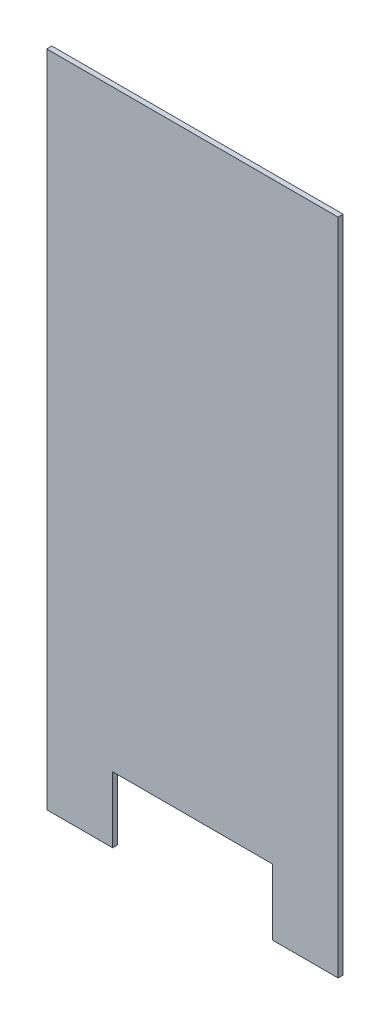
ISO-10303-21;
HEADER;
FILE_DESCRIPTION(('STEP AP214'),'2;1');
FILE_NAME('part.step','',(''),(''),'','','');
FILE_SCHEMA(('AUTOMOTIVE_DESIGN { 1 0 10303 214 1 1 1 1 }'));
ENDSEC;
DATA;
#1=APPLICATION_CONTEXT('core data for automotive mechanical design processes');
#2=APPLICATION_PROTOCOL_DEFINITION('international standard','automotive_design',2000,#1);
#3=PRODUCT_CONTEXT('',#1,'mechanical');
#4=PRODUCT('Part','Part','',(#3));
#5=PRODUCT_RELATED_PRODUCT_CATEGORY('part','',(#4));
#6=PRODUCT_DEFINITION_FORMATION('','',#4);
#7=PRODUCT_DEFINITION_CONTEXT('part definition',#1,'design');
#8=PRODUCT_DEFINITION('design','',#6,#7);
#9=PRODUCT_DEFINITION_SHAPE('','',#8);
#10=(LENGTH_UNIT() NAMED_UNIT(*) SI_UNIT(.MILLI.,.METRE.));
#11=(NAMED_UNIT(*) PLANE_ANGLE_UNIT() SI_UNIT($,.RADIAN.));
#12=(NAMED_UNIT(*) SI_UNIT($,.STERADIAN.) SOLID_ANGLE_UNIT());
#13=UNCERTAINTY_MEASURE_WITH_UNIT(LENGTH_MEASURE(1.E-05),#10,'distance_accuracy_value','');
#14=(GEOMETRIC_REPRESENTATION_CONTEXT(3) GLOBAL_UNCERTAINTY_ASSIGNED_CONTEXT((#13)) GLOBAL_UNIT_ASSIGNED_CONTEXT((#10,
#11,#12)) REPRESENTATION_CONTEXT('',''));
#15=CARTESIAN_POINT('',(0.,0.,0.));
#16=DIRECTION('',(0.,0.,1.));
#17=DIRECTION('',(1.,0.,0.));
#18=AXIS2_PLACEMENT_3D('',#15,#16,#17);
#19=CARTESIAN_POINT('',(157.5,-650.25,10.));
#20=DIRECTION('',(0.,1.,0.));
#21=DIRECTION('',(0.,0.,1.));
#22=AXIS2_PLACEMENT_3D('',#19,#20,#21);
#23=PLANE('',#22);
#24=DIRECTION('',(1.,0.,0.));
#25=VECTOR('',#24,1.);
#26=CARTESIAN_POINT('',(157.5,-650.25,0.));
#27=LINE('',#26,#25);
#28=CARTESIAN_POINT('',(157.5,-650.25,0.));
#29=VERTEX_POINT('',#28);
#30=CARTESIAN_POINT('',(287.5,-650.25,0.));
#31=VERTEX_POINT('',#30);
#32=EDGE_CURVE('E129',#29,#31,#27,.T.);
#33=ORIENTED_EDGE('',*,*,#32,.T.);
#34=DIRECTION('',(0.,0.,-1.));
#35=VECTOR('',#34,1.);
#36=CARTESIAN_POINT('',(287.5,-650.25,10.));
#37=LINE('',#36,#35);
#38=CARTESIAN_POINT('',(287.5,-650.25,10.));
#39=VERTEX_POINT('',#38);
#40=EDGE_CURVE('E11',#39,#31,#37,.T.);
#41=ORIENTED_EDGE('',*,*,#40,.F.);
#42=DIRECTION('',(1.,0.,0.));
#43=VECTOR('',#42,1.);
#44=CARTESIAN_POINT('',(157.5,-650.25,10.));
#45=LINE('',#44,#43);
#46=CARTESIAN_POINT('',(157.5,-650.25,10.));
#47=VERTEX_POINT('',#46);
#48=EDGE_CURVE('E143',#47,#39,#45,.T.);
#49=ORIENTED_EDGE('',*,*,#48,.F.);
#50=DIRECTION('',(0.,0.,-1.));
#51=VECTOR('',#50,1.);
#52=CARTESIAN_POINT('',(157.5,-650.25,10.));
#53=LINE('',#52,#51);
#54=EDGE_CURVE('E125',#47,#29,#53,.T.);
#55=ORIENTED_EDGE('',*,*,#54,.T.);
#56=EDGE_LOOP('',(#33,#41,#49,#55));
#57=FACE_BOUND('',#56,.T.);
#58=ADVANCED_FACE('F33',(#57),#23,.F.);
#59=CARTESIAN_POINT('',(287.5,650.25,10.));
#60=DIRECTION('',(-1.,0.,0.));
#61=DIRECTION('',(0.,-1.,0.));
#62=AXIS2_PLACEMENT_3D('',#59,#60,#61);
#63=PLANE('',#62);
#64=DIRECTION('',(0.,1.,0.));
#65=VECTOR('',#64,1.);
#66=CARTESIAN_POINT('',(287.5,650.25,0.));
#67=LINE('',#66,#65);
#68=CARTESIAN_POINT('',(287.5,650.25,0.));
#69=VERTEX_POINT('',#68);
#70=EDGE_CURVE('E132',#31,#69,#67,.T.);
#71=ORIENTED_EDGE('',*,*,#70,.T.);
#72=DIRECTION('',(0.,0.,-1.));
#73=VECTOR('',#72,1.);
#74=CARTESIAN_POINT('',(287.5,650.25,10.));
#75=LINE('',#74,#73);
#76=CARTESIAN_POINT('',(287.5,650.25,10.));
#77=VERTEX_POINT('',#76);
#78=EDGE_CURVE('E41',#77,#69,#75,.T.);
#79=ORIENTED_EDGE('',*,*,#78,.F.);
#80=DIRECTION('',(0.,1.,0.));
#81=VECTOR('',#80,1.);
#82=CARTESIAN_POINT('',(287.5,650.25,10.));
#83=LINE('',#82,#81);
#84=EDGE_CURVE('E92',#39,#77,#83,.T.);
#85=ORIENTED_EDGE('',*,*,#84,.F.);
#86=ORIENTED_EDGE('',*,*,#40,.T.);
#87=EDGE_LOOP('',(#71,#79,#85,#86));
#88=FACE_BOUND('',#87,.T.);
#89=ADVANCED_FACE('F178',(#88),#63,.F.);
#90=CARTESIAN_POINT('',(-287.5,650.25,10.));
#91=DIRECTION('',(0.,-1.,0.));
#92=DIRECTION('',(0.,0.,-1.));
#93=AXIS2_PLACEMENT_3D('',#90,#91,#92);
#94=PLANE('',#93);
#95=DIRECTION('',(-1.,0.,0.));
#96=VECTOR('',#95,1.);
#97=CARTESIAN_POINT('',(-287.5,650.25,0.));
#98=LINE('',#97,#96);
#99=CARTESIAN_POINT('',(-287.5,650.25,0.));
#100=VERTEX_POINT('',#99);
#101=EDGE_CURVE('E134',#69,#100,#98,.T.);
#102=ORIENTED_EDGE('',*,*,#101,.T.);
#103=DIRECTION('',(0.,0.,-1.));
#104=VECTOR('',#103,1.);
#105=CARTESIAN_POINT('',(-287.5,650.25,10.));
#106=LINE('',#105,#104);
#107=CARTESIAN_POINT('',(-287.5,650.25,10.));
#108=VERTEX_POINT('',#107);
#109=EDGE_CURVE('E150',#108,#100,#106,.T.);
#110=ORIENTED_EDGE('',*,*,#109,.F.);
#111=DIRECTION('',(-1.,0.,0.));
#112=VECTOR('',#111,1.);
#113=CARTESIAN_POINT('',(-287.5,650.25,10.));
#114=LINE('',#113,#112);
#115=EDGE_CURVE('E158',#77,#108,#114,.T.);
#116=ORIENTED_EDGE('',*,*,#115,.F.);
#117=ORIENTED_EDGE('',*,*,#78,.T.);
#118=EDGE_LOOP('',(#102,#110,#116,#117));
#119=FACE_BOUND('',#118,.T.);
#120=ADVANCED_FACE('F156',(#119),#94,.F.);
#121=CARTESIAN_POINT('',(-287.5,650.25,10.));
#122=DIRECTION('',(1.,0.,0.));
#123=DIRECTION('',(0.,1.,0.));
#124=AXIS2_PLACEMENT_3D('',#121,#122,#123);
#125=PLANE('',#124);
#126=DIRECTION('',(0.,-1.,0.));
#127=VECTOR('',#126,1.);
#128=CARTESIAN_POINT('',(-287.5,650.25,0.));
#129=LINE('',#128,#127);
#130=CARTESIAN_POINT('',(-287.5,-650.25,0.));
#131=VERTEX_POINT('',#130);
#132=EDGE_CURVE('E136',#100,#131,#129,.T.);
#133=ORIENTED_EDGE('',*,*,#132,.T.);
#134=DIRECTION('',(0.,0.,-1.));
#135=VECTOR('',#134,1.);
#136=CARTESIAN_POINT('',(-287.5,-650.25,10.));
#137=LINE('',#136,#135);
#138=CARTESIAN_POINT('',(-287.5,-650.25,10.));
#139=VERTEX_POINT('',#138);
#140=EDGE_CURVE('E147',#139,#131,#137,.T.);
#141=ORIENTED_EDGE('',*,*,#140,.F.);
#142=DIRECTION('',(0.,-1.,0.));
#143=VECTOR('',#142,1.);
#144=CARTESIAN_POINT('',(-287.5,650.25,10.));
#145=LINE('',#144,#143);
#146=EDGE_CURVE('E170',#108,#139,#145,.T.);
#147=ORIENTED_EDGE('',*,*,#146,.F.);
#148=ORIENTED_EDGE('',*,*,#109,.T.);
#149=EDGE_LOOP('',(#133,#141,#147,#148));
#150=FACE_BOUND('',#149,.T.);
#151=ADVANCED_FACE('F166',(#150),#125,.F.);
#152=CARTESIAN_POINT('',(-287.5,-650.25,10.));
#153=DIRECTION('',(0.,1.,0.));
#154=DIRECTION('',(0.,0.,1.));
#155=AXIS2_PLACEMENT_3D('',#152,#153,#154);
#156=PLANE('',#155);
#157=DIRECTION('',(1.,0.,0.));
#158=VECTOR('',#157,1.);
#159=CARTESIAN_POINT('',(-287.5,-650.25,0.));
#160=LINE('',#159,#158);
#161=CARTESIAN_POINT('',(-157.5,-650.25,0.));
#162=VERTEX_POINT('',#161);
#163=EDGE_CURVE('E138',#131,#162,#160,.T.);
#164=ORIENTED_EDGE('',*,*,#163,.T.);
#165=DIRECTION('',(0.,0.,-1.));
#166=VECTOR('',#165,1.);
#167=CARTESIAN_POINT('',(-157.5,-650.25,10.));
#168=LINE('',#167,#166);
#169=CARTESIAN_POINT('',(-157.5,-650.25,10.));
#170=VERTEX_POINT('',#169);
#171=EDGE_CURVE('E120',#170,#162,#168,.T.);
#172=ORIENTED_EDGE('',*,*,#171,.F.);
#173=DIRECTION('',(1.,0.,0.));
#174=VECTOR('',#173,1.);
#175=CARTESIAN_POINT('',(-287.5,-650.25,10.));
#176=LINE('',#175,#174);
#177=EDGE_CURVE('E111',#139,#170,#176,.T.);
#178=ORIENTED_EDGE('',*,*,#177,.F.);
#179=ORIENTED_EDGE('',*,*,#140,.T.);
#180=EDGE_LOOP('',(#164,#172,#178,#179));
#181=FACE_BOUND('',#180,.T.);
#182=ADVANCED_FACE('F169',(#181),#156,.F.);
#183=CARTESIAN_POINT('',(-157.5,-520.25,10.));
#184=DIRECTION('',(-1.,0.,0.));
#185=DIRECTION('',(0.,-1.,0.));
#186=AXIS2_PLACEMENT_3D('',#183,#184,#185);
#187=PLANE('',#186);
#188=DIRECTION('',(0.,1.,0.));
#189=VECTOR('',#188,1.);
#190=CARTESIAN_POINT('',(-157.5,-520.25,0.));
#191=LINE('',#190,#189);
#192=CARTESIAN_POINT('',(-157.5,-520.25,0.));
#193=VERTEX_POINT('',#192);
#194=EDGE_CURVE('E119',#162,#193,#191,.T.);
#195=ORIENTED_EDGE('',*,*,#194,.T.);
#196=DIRECTION('',(0.,0.,-1.));
#197=VECTOR('',#196,1.);
#198=CARTESIAN_POINT('',(-157.5,-520.25,10.));
#199=LINE('',#198,#197);
#200=CARTESIAN_POINT('',(-157.5,-520.25,10.));
#201=VERTEX_POINT('',#200);
#202=EDGE_CURVE('E116',#201,#193,#199,.T.);
#203=ORIENTED_EDGE('',*,*,#202,.F.);
#204=DIRECTION('',(0.,1.,0.));
#205=VECTOR('',#204,1.);
#206=CARTESIAN_POINT('',(-157.5,-520.25,10.));
#207=LINE('',#206,#205);
#208=EDGE_CURVE('E105',#170,#201,#207,.T.);
#209=ORIENTED_EDGE('',*,*,#208,.F.);
#210=ORIENTED_EDGE('',*,*,#171,.T.);
#211=EDGE_LOOP('',(#195,#203,#209,#210));
#212=FACE_BOUND('',#211,.T.);
#213=ADVANCED_FACE('F117',(#212),#187,.F.);
#214=CARTESIAN_POINT('',(-157.5,-520.25,10.));
#215=DIRECTION('',(0.,1.,0.));
#216=DIRECTION('',(0.,0.,1.));
#217=AXIS2_PLACEMENT_3D('',#214,#215,#216);
#218=PLANE('',#217);
#219=DIRECTION('',(1.,0.,0.));
#220=VECTOR('',#219,1.);
#221=CARTESIAN_POINT('',(-157.5,-520.25,0.));
#222=LINE('',#221,#220);
#223=CARTESIAN_POINT('',(157.5,-520.25,0.));
#224=VERTEX_POINT('',#223);
#225=EDGE_CURVE('E78',#193,#224,#222,.T.);
#226=ORIENTED_EDGE('',*,*,#225,.T.);
#227=DIRECTION('',(0.,0.,-1.));
#228=VECTOR('',#227,1.);
#229=CARTESIAN_POINT('',(157.5,-520.25,10.));
#230=LINE('',#229,#228);
#231=CARTESIAN_POINT('',(157.5,-520.25,10.));
#232=VERTEX_POINT('',#231);
#233=EDGE_CURVE('E121',#232,#224,#230,.T.);
#234=ORIENTED_EDGE('',*,*,#233,.F.);
#235=DIRECTION('',(1.,0.,0.));
#236=VECTOR('',#235,1.);
#237=CARTESIAN_POINT('',(-157.5,-520.25,10.));
#238=LINE('',#237,#236);
#239=EDGE_CURVE('E109',#201,#232,#238,.T.);
#240=ORIENTED_EDGE('',*,*,#239,.F.);
#241=ORIENTED_EDGE('',*,*,#202,.T.);
#242=EDGE_LOOP('',(#226,#234,#240,#241));
#243=FACE_BOUND('',#242,.T.);
#244=ADVANCED_FACE('F123',(#243),#218,.F.);
#245=CARTESIAN_POINT('',(157.5,-520.25,10.));
#246=DIRECTION('',(1.,0.,0.));
#247=DIRECTION('',(0.,1.,0.));
#248=AXIS2_PLACEMENT_3D('',#245,#246,#247);
#249=PLANE('',#248);
#250=DIRECTION('',(0.,-1.,0.));
#251=VECTOR('',#250,1.);
#252=CARTESIAN_POINT('',(157.5,-520.25,0.));
#253=LINE('',#252,#251);
#254=EDGE_CURVE('E84',#224,#29,#253,.T.);
#255=ORIENTED_EDGE('',*,*,#254,.T.);
#256=ORIENTED_EDGE('',*,*,#54,.F.);
#257=DIRECTION('',(0.,-1.,0.));
#258=VECTOR('',#257,1.);
#259=CARTESIAN_POINT('',(157.5,-520.25,10.));
#260=LINE('',#259,#258);
#261=EDGE_CURVE('E49',#232,#47,#260,.T.);
#262=ORIENTED_EDGE('',*,*,#261,.F.);
#263=ORIENTED_EDGE('',*,*,#233,.T.);
#264=EDGE_LOOP('',(#255,#256,#262,#263));
#265=FACE_BOUND('',#264,.T.);
#266=ADVANCED_FACE('F194',(#265),#249,.F.);
#267=CARTESIAN_POINT('',(0.,0.,10.));
#268=DIRECTION('',(0.,0.,-1.));
#269=DIRECTION('',(-1.,0.,0.));
#270=AXIS2_PLACEMENT_3D('',#267,#268,#269);
#271=PLANE('',#270);
#272=ORIENTED_EDGE('',*,*,#48,.T.);
#273=ORIENTED_EDGE('',*,*,#84,.T.);
#274=ORIENTED_EDGE('',*,*,#115,.T.);
#275=ORIENTED_EDGE('',*,*,#146,.T.);
#276=ORIENTED_EDGE('',*,*,#177,.T.);
#277=ORIENTED_EDGE('',*,*,#208,.T.);
#278=ORIENTED_EDGE('',*,*,#239,.T.);
#279=ORIENTED_EDGE('',*,*,#261,.T.);
#280=EDGE_LOOP('',(#272,#273,#274,#275,#276,#277,#278,#279));
#281=FACE_BOUND('',#280,.T.);
#282=ADVANCED_FACE('F107',(#281),#271,.F.);
#283=CARTESIAN_POINT('',(0.,0.,0.));
#284=DIRECTION('',(0.,0.,-1.));
#285=DIRECTION('',(-1.,0.,0.));
#286=AXIS2_PLACEMENT_3D('',#283,#284,#285);
#287=PLANE('',#286);
#288=ORIENTED_EDGE('',*,*,#32,.F.);
#289=ORIENTED_EDGE('',*,*,#254,.F.);
#290=ORIENTED_EDGE('',*,*,#225,.F.);
#291=ORIENTED_EDGE('',*,*,#194,.F.);
#292=ORIENTED_EDGE('',*,*,#163,.F.);
#293=ORIENTED_EDGE('',*,*,#132,.F.);
#294=ORIENTED_EDGE('',*,*,#101,.F.);
#295=ORIENTED_EDGE('',*,*,#70,.F.);
#296=EDGE_LOOP('',(#288,#289,#290,#291,#292,#293,#294,#295));
#297=FACE_BOUND('',#296,.T.);
#298=ADVANCED_FACE('F162',(#297),#287,.T.);
#299=CLOSED_SHELL('',(#58,#89,#120,#151,#182,#213,#244,#266,#282,#298));
#300=MANIFOLD_SOLID_BREP('B2',#299);
#301=ADVANCED_BREP_SHAPE_REPRESENTATION('',(#18,#300),#14);
#302=SHAPE_DEFINITION_REPRESENTATION(#9,#301);
ENDSEC;
END-ISO-10303-21;
